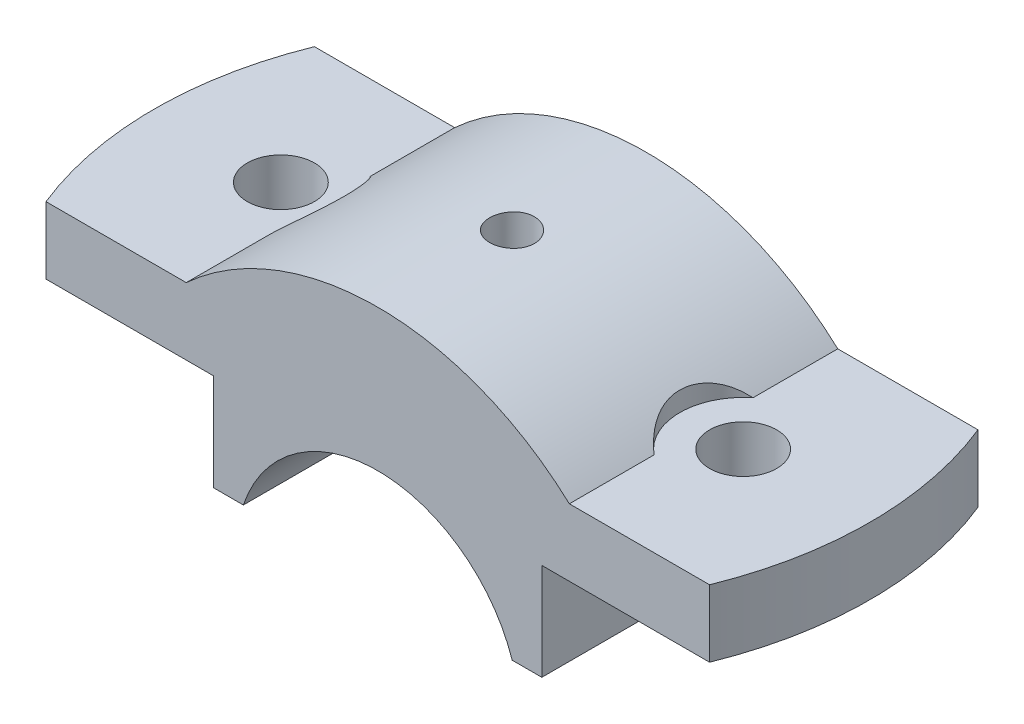
ISO-10303-21;
HEADER;
FILE_DESCRIPTION(('STEP AP214'),'2;1');
FILE_NAME('part.step','',(''),(''),'','','');
FILE_SCHEMA(('AUTOMOTIVE_DESIGN { 1 0 10303 214 1 1 1 1 }'));
ENDSEC;
DATA;
#1=APPLICATION_CONTEXT('core data for automotive mechanical design processes');
#2=APPLICATION_PROTOCOL_DEFINITION('international standard','automotive_design',2000,#1);
#3=PRODUCT_CONTEXT('',#1,'mechanical');
#4=PRODUCT('Part','Part','',(#3));
#5=PRODUCT_RELATED_PRODUCT_CATEGORY('part','',(#4));
#6=PRODUCT_DEFINITION_FORMATION('','',#4);
#7=PRODUCT_DEFINITION_CONTEXT('part definition',#1,'design');
#8=PRODUCT_DEFINITION('design','',#6,#7);
#9=PRODUCT_DEFINITION_SHAPE('','',#8);
#10=(LENGTH_UNIT() NAMED_UNIT(*) SI_UNIT(.MILLI.,.METRE.));
#11=(NAMED_UNIT(*) PLANE_ANGLE_UNIT() SI_UNIT($,.RADIAN.));
#12=(NAMED_UNIT(*) SI_UNIT($,.STERADIAN.) SOLID_ANGLE_UNIT());
#13=UNCERTAINTY_MEASURE_WITH_UNIT(LENGTH_MEASURE(1.E-05),#10,'distance_accuracy_value','');
#14=(GEOMETRIC_REPRESENTATION_CONTEXT(3) GLOBAL_UNCERTAINTY_ASSIGNED_CONTEXT((#13)) GLOBAL_UNIT_ASSIGNED_CONTEXT((#10,
#11,#12)) REPRESENTATION_CONTEXT('',''));
#15=CARTESIAN_POINT('',(0.,0.,0.));
#16=DIRECTION('',(0.,0.,1.));
#17=DIRECTION('',(1.,0.,0.));
#18=AXIS2_PLACEMENT_3D('',#15,#16,#17);
#19=CARTESIAN_POINT('',(22.,19.,18.));
#20=DIRECTION('',(0.,1.,0.));
#21=DIRECTION('',(-1.,0.,0.));
#22=AXIS2_PLACEMENT_3D('',#19,#20,#21);
#23=PLANE('',#22);
#24=CARTESIAN_POINT('',(31.,19.,0.));
#25=DIRECTION('',(0.,1.,0.));
#26=DIRECTION('',(0.,0.,1.));
#27=AXIS2_PLACEMENT_3D('',#24,#25,#26);
#28=CIRCLE('',#27,4.49999999999999);
#29=CARTESIAN_POINT('',(31.,19.,4.49999999999999));
#30=VERTEX_POINT('',#29);
#31=EDGE_CURVE('E325',#30,#30,#28,.T.);
#32=ORIENTED_EDGE('',*,*,#31,.T.);
#33=EDGE_LOOP('',(#32));
#34=FACE_BOUND('',#33,.T.);
#35=CARTESIAN_POINT('',(0.,19.,0.));
#36=DIRECTION('',(0.,1.,0.));
#37=DIRECTION('',(1.,0.,0.));
#38=AXIS2_PLACEMENT_3D('',#35,#36,#37);
#39=CIRCLE('',#38,48.);
#40=CARTESIAN_POINT('',(44.497190922574,19.,18.));
#41=VERTEX_POINT('',#40);
#42=CARTESIAN_POINT('',(44.497190922574,19.,-18.));
#43=VERTEX_POINT('',#42);
#44=EDGE_CURVE('E54',#41,#43,#39,.T.);
#45=ORIENTED_EDGE('',*,*,#44,.F.);
#46=DIRECTION('',(1.,0.,0.));
#47=VECTOR('',#46,1.);
#48=CARTESIAN_POINT('',(22.,19.,18.));
#49=LINE('',#48,#47);
#50=CARTESIAN_POINT('',(22.,19.,18.));
#51=VERTEX_POINT('',#50);
#52=EDGE_CURVE('E152',#51,#41,#49,.T.);
#53=ORIENTED_EDGE('',*,*,#52,.F.);
#54=DIRECTION('',(0.,0.,-1.));
#55=VECTOR('',#54,1.);
#56=CARTESIAN_POINT('',(22.,19.,18.));
#57=LINE('',#56,#55);
#58=CARTESIAN_POINT('',(22.,19.,-18.));
#59=VERTEX_POINT('',#58);
#60=EDGE_CURVE('E229',#51,#59,#57,.T.);
#61=ORIENTED_EDGE('',*,*,#60,.T.);
#62=DIRECTION('',(1.,0.,0.));
#63=VECTOR('',#62,1.);
#64=CARTESIAN_POINT('',(22.,19.,-18.));
#65=LINE('',#64,#63);
#66=EDGE_CURVE('E154',#59,#43,#65,.T.);
#67=ORIENTED_EDGE('',*,*,#66,.T.);
#68=EDGE_LOOP('',(#45,#53,#61,#67));
#69=FACE_BOUND('',#68,.T.);
#70=ADVANCED_FACE('F34',(#34,#69),#23,.F.);
#71=CARTESIAN_POINT('',(50.,28.,18.));
#72=DIRECTION('',(0.,-1.,0.));
#73=DIRECTION('',(1.,0.,0.));
#74=AXIS2_PLACEMENT_3D('',#71,#72,#73);
#75=PLANE('',#74);
#76=CARTESIAN_POINT('',(31.,28.,0.));
#77=DIRECTION('',(0.,1.,0.));
#78=DIRECTION('',(0.,0.,1.));
#79=AXIS2_PLACEMENT_3D('',#76,#77,#78);
#80=CIRCLE('',#79,4.49999999999999);
#81=CARTESIAN_POINT('',(31.,28.,4.49999999999999));
#82=VERTEX_POINT('',#81);
#83=EDGE_CURVE('E320',#82,#82,#80,.T.);
#84=ORIENTED_EDGE('',*,*,#83,.F.);
#85=EDGE_LOOP('',(#84));
#86=FACE_BOUND('',#85,.T.);
#87=CARTESIAN_POINT('',(0.,28.,0.));
#88=DIRECTION('',(0.,1.,0.));
#89=DIRECTION('',(1.,0.,0.));
#90=AXIS2_PLACEMENT_3D('',#87,#88,#89);
#91=CIRCLE('',#90,48.);
#92=CARTESIAN_POINT('',(44.497190922574,28.,18.));
#93=VERTEX_POINT('',#92);
#94=CARTESIAN_POINT('',(44.497190922574,28.,-18.));
#95=VERTEX_POINT('',#94);
#96=EDGE_CURVE('E141',#93,#95,#91,.T.);
#97=ORIENTED_EDGE('',*,*,#96,.T.);
#98=DIRECTION('',(-1.,0.,0.));
#99=VECTOR('',#98,1.);
#100=CARTESIAN_POINT('',(50.,28.,-18.));
#101=LINE('',#100,#99);
#102=CARTESIAN_POINT('',(25.6904651573303,28.,-18.));
#103=VERTEX_POINT('',#102);
#104=EDGE_CURVE('E188',#95,#103,#101,.T.);
#105=ORIENTED_EDGE('',*,*,#104,.T.);
#106=DIRECTION('',(0.,0.,-1.));
#107=VECTOR('',#106,1.);
#108=CARTESIAN_POINT('',(25.6904651573303,28.,18.));
#109=LINE('',#108,#107);
#110=CARTESIAN_POINT('',(25.6904651573303,28.,-6.63768331230679));
#111=VERTEX_POINT('',#110);
#112=EDGE_CURVE('E223',#111,#103,#109,.T.);
#113=ORIENTED_EDGE('',*,*,#112,.F.);
#114=CARTESIAN_POINT('',(31.,28.,0.));
#115=DIRECTION('',(0.,-1.,0.));
#116=DIRECTION('',(1.,0.,0.));
#117=AXIS2_PLACEMENT_3D('',#114,#115,#116);
#118=CIRCLE('',#117,8.5);
#119=CARTESIAN_POINT('',(25.6904651573303,28.,6.63768331230679));
#120=VERTEX_POINT('',#119);
#121=EDGE_CURVE('E61',#120,#111,#118,.T.);
#122=ORIENTED_EDGE('',*,*,#121,.F.);
#123=CARTESIAN_POINT('',(25.6904651573303,28.,18.));
#124=VERTEX_POINT('',#123);
#125=EDGE_CURVE('E230',#124,#120,#109,.T.);
#126=ORIENTED_EDGE('',*,*,#125,.F.);
#127=DIRECTION('',(-1.,0.,0.));
#128=VECTOR('',#127,1.);
#129=CARTESIAN_POINT('',(50.,28.,18.));
#130=LINE('',#129,#128);
#131=EDGE_CURVE('E160',#93,#124,#130,.T.);
#132=ORIENTED_EDGE('',*,*,#131,.F.);
#133=EDGE_LOOP('',(#97,#105,#113,#122,#126,#132));
#134=FACE_BOUND('',#133,.T.);
#135=ADVANCED_FACE('F341',(#86,#134),#75,.F.);
#136=CARTESIAN_POINT('',(0.,0.,18.));
#137=DIRECTION('',(0.,0.,1.));
#138=DIRECTION('',(1.,0.,0.));
#139=AXIS2_PLACEMENT_3D('',#136,#137,#138);
#140=PLANE('',#139);
#141=ORIENTED_EDGE('',*,*,#52,.T.);
#142=DIRECTION('',(0.,1.,0.));
#143=VECTOR('',#142,1.);
#144=CARTESIAN_POINT('',(44.497190922574,19.,18.));
#145=LINE('',#144,#143);
#146=EDGE_CURVE('E138',#41,#93,#145,.T.);
#147=ORIENTED_EDGE('',*,*,#146,.T.);
#148=ORIENTED_EDGE('',*,*,#131,.T.);
#149=CARTESIAN_POINT('',(0.,0.,18.));
#150=DIRECTION('',(0.,0.,1.));
#151=DIRECTION('',(1.,0.,0.));
#152=AXIS2_PLACEMENT_3D('',#149,#150,#151);
#153=CIRCLE('',#152,38.);
#154=CARTESIAN_POINT('',(-25.6904651573303,28.,18.));
#155=VERTEX_POINT('',#154);
#156=EDGE_CURVE('E162',#124,#155,#153,.T.);
#157=ORIENTED_EDGE('',*,*,#156,.T.);
#158=DIRECTION('',(-1.,0.,0.));
#159=VECTOR('',#158,1.);
#160=CARTESIAN_POINT('',(-50.,28.,18.));
#161=LINE('',#160,#159);
#162=CARTESIAN_POINT('',(-44.497190922574,28.,18.));
#163=VERTEX_POINT('',#162);
#164=EDGE_CURVE('E169',#155,#163,#161,.T.);
#165=ORIENTED_EDGE('',*,*,#164,.T.);
#166=DIRECTION('',(0.,1.,0.));
#167=VECTOR('',#166,1.);
#168=CARTESIAN_POINT('',(-44.497190922574,19.,18.));
#169=LINE('',#168,#167);
#170=CARTESIAN_POINT('',(-44.497190922574,19.,18.));
#171=VERTEX_POINT('',#170);
#172=EDGE_CURVE('E289',#171,#163,#169,.T.);
#173=ORIENTED_EDGE('',*,*,#172,.F.);
#174=DIRECTION('',(1.,0.,0.));
#175=VECTOR('',#174,1.);
#176=CARTESIAN_POINT('',(-22.,19.,18.));
#177=LINE('',#176,#175);
#178=CARTESIAN_POINT('',(-22.,19.,18.));
#179=VERTEX_POINT('',#178);
#180=EDGE_CURVE('E172',#171,#179,#177,.T.);
#181=ORIENTED_EDGE('',*,*,#180,.T.);
#182=DIRECTION('',(0.,-1.,0.));
#183=VECTOR('',#182,1.);
#184=CARTESIAN_POINT('',(-22.,6.,18.));
#185=LINE('',#184,#183);
#186=CARTESIAN_POINT('',(-22.,6.,18.));
#187=VERTEX_POINT('',#186);
#188=EDGE_CURVE('E174',#179,#187,#185,.T.);
#189=ORIENTED_EDGE('',*,*,#188,.T.);
#190=DIRECTION('',(1.,0.,0.));
#191=VECTOR('',#190,1.);
#192=CARTESIAN_POINT('',(-18.0277563773199,6.,18.));
#193=LINE('',#192,#191);
#194=CARTESIAN_POINT('',(-18.0277563773199,6.,18.));
#195=VERTEX_POINT('',#194);
#196=EDGE_CURVE('E176',#187,#195,#193,.T.);
#197=ORIENTED_EDGE('',*,*,#196,.T.);
#198=CARTESIAN_POINT('',(0.,0.,18.));
#199=DIRECTION('',(0.,0.,-1.));
#200=DIRECTION('',(1.,0.,0.));
#201=AXIS2_PLACEMENT_3D('',#198,#199,#200);
#202=CIRCLE('',#201,19.);
#203=CARTESIAN_POINT('',(18.0277563773199,6.00000000000001,18.));
#204=VERTEX_POINT('',#203);
#205=EDGE_CURVE('E202',#195,#204,#202,.T.);
#206=ORIENTED_EDGE('',*,*,#205,.T.);
#207=DIRECTION('',(1.,0.,0.));
#208=VECTOR('',#207,1.);
#209=CARTESIAN_POINT('',(18.0277563773199,6.00000000000001,18.));
#210=LINE('',#209,#208);
#211=CARTESIAN_POINT('',(22.,6.,18.));
#212=VERTEX_POINT('',#211);
#213=EDGE_CURVE('E164',#204,#212,#210,.T.);
#214=ORIENTED_EDGE('',*,*,#213,.T.);
#215=DIRECTION('',(0.,1.,0.));
#216=VECTOR('',#215,1.);
#217=CARTESIAN_POINT('',(22.,6.,18.));
#218=LINE('',#217,#216);
#219=EDGE_CURVE('E158',#212,#51,#218,.T.);
#220=ORIENTED_EDGE('',*,*,#219,.T.);
#221=EDGE_LOOP('',(#141,#147,#148,#157,#165,#173,#181,#189,#197,#206,#214,#220));
#222=FACE_BOUND('',#221,.T.);
#223=ADVANCED_FACE('F156',(#222),#140,.T.);
#224=CARTESIAN_POINT('',(0.,0.,-18.));
#225=DIRECTION('',(0.,0.,1.));
#226=DIRECTION('',(1.,0.,0.));
#227=AXIS2_PLACEMENT_3D('',#224,#225,#226);
#228=PLANE('',#227);
#229=DIRECTION('',(0.,1.,0.));
#230=VECTOR('',#229,1.);
#231=CARTESIAN_POINT('',(44.497190922574,19.,-18.));
#232=LINE('',#231,#230);
#233=EDGE_CURVE('E146',#43,#95,#232,.T.);
#234=ORIENTED_EDGE('',*,*,#233,.F.);
#235=ORIENTED_EDGE('',*,*,#66,.F.);
#236=DIRECTION('',(0.,1.,0.));
#237=VECTOR('',#236,1.);
#238=CARTESIAN_POINT('',(22.,6.,-18.));
#239=LINE('',#238,#237);
#240=CARTESIAN_POINT('',(22.,6.,-18.));
#241=VERTEX_POINT('',#240);
#242=EDGE_CURVE('E185',#241,#59,#239,.T.);
#243=ORIENTED_EDGE('',*,*,#242,.F.);
#244=DIRECTION('',(1.,0.,0.));
#245=VECTOR('',#244,1.);
#246=CARTESIAN_POINT('',(18.0277563773199,6.00000000000001,-18.));
#247=LINE('',#246,#245);
#248=CARTESIAN_POINT('',(18.0277563773199,6.00000000000001,-18.));
#249=VERTEX_POINT('',#248);
#250=EDGE_CURVE('E182',#249,#241,#247,.T.);
#251=ORIENTED_EDGE('',*,*,#250,.F.);
#252=CARTESIAN_POINT('',(0.,0.,-18.));
#253=DIRECTION('',(0.,0.,-1.));
#254=DIRECTION('',(1.,0.,0.));
#255=AXIS2_PLACEMENT_3D('',#252,#253,#254);
#256=CIRCLE('',#255,19.);
#257=CARTESIAN_POINT('',(-18.0277563773199,6.,-18.));
#258=VERTEX_POINT('',#257);
#259=EDGE_CURVE('E179',#258,#249,#256,.T.);
#260=ORIENTED_EDGE('',*,*,#259,.F.);
#261=DIRECTION('',(1.,0.,0.));
#262=VECTOR('',#261,1.);
#263=CARTESIAN_POINT('',(-18.0277563773199,6.,-18.));
#264=LINE('',#263,#262);
#265=CARTESIAN_POINT('',(-22.,6.,-18.));
#266=VERTEX_POINT('',#265);
#267=EDGE_CURVE('E200',#266,#258,#264,.T.);
#268=ORIENTED_EDGE('',*,*,#267,.F.);
#269=DIRECTION('',(0.,-1.,0.));
#270=VECTOR('',#269,1.);
#271=CARTESIAN_POINT('',(-22.,6.,-18.));
#272=LINE('',#271,#270);
#273=CARTESIAN_POINT('',(-22.,19.,-18.));
#274=VERTEX_POINT('',#273);
#275=EDGE_CURVE('E198',#274,#266,#272,.T.);
#276=ORIENTED_EDGE('',*,*,#275,.F.);
#277=DIRECTION('',(1.,0.,0.));
#278=VECTOR('',#277,1.);
#279=CARTESIAN_POINT('',(-22.,19.,-18.));
#280=LINE('',#279,#278);
#281=CARTESIAN_POINT('',(-44.497190922574,19.,-18.));
#282=VERTEX_POINT('',#281);
#283=EDGE_CURVE('E196',#282,#274,#280,.T.);
#284=ORIENTED_EDGE('',*,*,#283,.F.);
#285=DIRECTION('',(0.,1.,0.));
#286=VECTOR('',#285,1.);
#287=CARTESIAN_POINT('',(-44.497190922574,19.,-18.));
#288=LINE('',#287,#286);
#289=CARTESIAN_POINT('',(-44.497190922574,28.,-18.));
#290=VERTEX_POINT('',#289);
#291=EDGE_CURVE('E183',#282,#290,#288,.T.);
#292=ORIENTED_EDGE('',*,*,#291,.T.);
#293=DIRECTION('',(-1.,0.,0.));
#294=VECTOR('',#293,1.);
#295=CARTESIAN_POINT('',(-50.,28.,-18.));
#296=LINE('',#295,#294);
#297=CARTESIAN_POINT('',(-25.6904651573303,28.,-18.));
#298=VERTEX_POINT('',#297);
#299=EDGE_CURVE('E193',#298,#290,#296,.T.);
#300=ORIENTED_EDGE('',*,*,#299,.F.);
#301=CARTESIAN_POINT('',(0.,0.,-18.));
#302=DIRECTION('',(0.,0.,1.));
#303=DIRECTION('',(1.,0.,0.));
#304=AXIS2_PLACEMENT_3D('',#301,#302,#303);
#305=CIRCLE('',#304,38.);
#306=EDGE_CURVE('E190',#103,#298,#305,.T.);
#307=ORIENTED_EDGE('',*,*,#306,.F.);
#308=ORIENTED_EDGE('',*,*,#104,.F.);
#309=EDGE_LOOP('',(#234,#235,#243,#251,#260,#268,#276,#284,#292,#300,#307,#308));
#310=FACE_BOUND('',#309,.T.);
#311=ADVANCED_FACE('F304',(#310),#228,.F.);
#312=CARTESIAN_POINT('',(0.,0.,18.));
#313=DIRECTION('',(0.,0.,-1.));
#314=DIRECTION('',(-1.,0.,0.));
#315=AXIS2_PLACEMENT_3D('',#312,#313,#314);
#316=CYLINDRICAL_SURFACE('',#315,38.);
#317=CARTESIAN_POINT('',(0.,38.,3.));
#318=CARTESIAN_POINT('',(-0.168230277437706,37.9999984430739,2.99999263868346));
#319=CARTESIAN_POINT('',(-0.336575845655095,37.9988709200709,2.98580169916932));
#320=CARTESIAN_POINT('',(-0.668611397196742,37.9944814128081,2.92939894930333));
#321=CARTESIAN_POINT('',(-0.832295850092009,37.9912169949171,2.88715518982943));
#322=CARTESIAN_POINT('',(-1.15015205512757,37.9829226863334,2.77587406357067));
#323=CARTESIAN_POINT('',(-1.3043290493551,37.9778937789402,2.70685161752221));
#324=CARTESIAN_POINT('',(-1.59887136159142,37.9666348413683,2.54399853963546));
#325=CARTESIAN_POINT('',(-1.73923967362019,37.9604050724332,2.45017330191646));
#326=CARTESIAN_POINT('',(-2.00254103126273,37.9474277075509,2.24014409327318));
#327=CARTESIAN_POINT('',(-2.12543792166293,37.9406790810774,2.1238948563935));
#328=CARTESIAN_POINT('',(-2.34999780988339,37.9274332919605,1.87241281605956));
#329=CARTESIAN_POINT('',(-2.45165988585507,37.9209361402441,1.73717918887838));
#330=CARTESIAN_POINT('',(-2.63098484586302,37.9089176287414,1.45135065682847));
#331=CARTESIAN_POINT('',(-2.708616254697,37.903397552738,1.30073594623714));
#332=CARTESIAN_POINT('',(-2.83747510230931,37.8939696224707,0.988558849059875));
#333=CARTESIAN_POINT('',(-2.8887029645124,37.8900617423529,0.826996638082311));
#334=CARTESIAN_POINT('',(-2.96319644645853,37.8843090780475,0.497870679819642));
#335=CARTESIAN_POINT('',(-2.98652059882487,37.8824599758018,0.330320257357771));
#336=CARTESIAN_POINT('',(-3.00472536931325,37.8810204867557,-0.00632681714997978));
#337=CARTESIAN_POINT('',(-2.99960647157769,37.8814300615093,-0.175423442828302));
#338=CARTESIAN_POINT('',(-2.96111886260011,37.8844577346025,-0.509962310035281));
#339=CARTESIAN_POINT('',(-2.92781369865023,37.8870708648728,-0.675411913710735));
#340=CARTESIAN_POINT('',(-2.83399765916122,37.8942034046858,-0.998365215123263));
#341=CARTESIAN_POINT('',(-2.77348654183749,37.8987228311701,-1.15586884222906));
#342=CARTESIAN_POINT('',(-2.62690490032728,37.9091644380148,-1.45866214971911));
#343=CARTESIAN_POINT('',(-2.54080579129679,37.9150881856644,-1.60393793599879));
#344=CARTESIAN_POINT('',(-2.34551283184452,37.9276694800349,-1.87799978791044));
#345=CARTESIAN_POINT('',(-2.23631856235736,37.9343270400699,-2.0067855542603));
#346=CARTESIAN_POINT('',(-1.99757813910437,37.947647885739,-2.24458115896057));
#347=CARTESIAN_POINT('',(-1.86797703439473,37.9543111370687,-2.35353583758633));
#348=CARTESIAN_POINT('',(-1.59229376436976,37.9668751419437,-2.54815019879117));
#349=CARTESIAN_POINT('',(-1.44621158946689,37.9727758950454,-2.63380986781872));
#350=CARTESIAN_POINT('',(-1.14167761997914,37.983150993084,-2.77939892547026));
#351=CARTESIAN_POINT('',(-0.98322469233549,37.9876252071703,-2.83932595392175));
#352=CARTESIAN_POINT('',(-0.658463212690179,37.9946415451888,-2.93171041942903));
#353=CARTESIAN_POINT('',(-0.492154807064349,37.997183705107,-2.96416836811962));
#354=CARTESIAN_POINT('',(-0.156881478742687,38.0000448768352,-3.00062434440681));
#355=CARTESIAN_POINT('',(0.0120751089608355,38.0003698415183,-3.00469857910482));
#356=CARTESIAN_POINT('',(0.348269003373996,37.9987758913175,-2.98447098943403));
#357=CARTESIAN_POINT('',(0.515506324442481,37.9968569951891,-2.96016940224689));
#358=CARTESIAN_POINT('',(0.843297753735751,37.9909950041868,-2.88394314979588));
#359=CARTESIAN_POINT('',(1.00386010671882,37.987054491835,-2.83205372367032));
#360=CARTESIAN_POINT('',(1.31399900365978,37.9775920824189,-2.70216068710782));
#361=CARTESIAN_POINT('',(1.46357539119334,37.9720701628431,-2.62415670492505));
#362=CARTESIAN_POINT('',(1.7478437504178,37.9600494395666,-2.44405671040129));
#363=CARTESIAN_POINT('',(1.88250358772923,37.953548595394,-2.34191011569745));
#364=CARTESIAN_POINT('',(2.13279217984116,37.9403075453845,-2.1164976605111));
#365=CARTESIAN_POINT('',(2.24842063776818,37.9335673358158,-1.99323147064188));
#366=CARTESIAN_POINT('',(2.4576248497514,37.9205896766453,-1.72874864835165));
#367=CARTESIAN_POINT('',(2.55115094155127,37.9143533795852,-1.58749266904679));
#368=CARTESIAN_POINT('',(2.713155238272,37.9031055627809,-1.29123629441747));
#369=CARTESIAN_POINT('',(2.78163367119924,37.8980940318878,-1.13623602422189));
#370=CARTESIAN_POINT('',(2.89151387110068,37.8898693720601,-0.817068099787171));
#371=CARTESIAN_POINT('',(2.93294623887224,37.8866542112497,-0.652911034998949));
#372=CARTESIAN_POINT('',(2.98765790023766,37.8823793491511,-0.319943850373176));
#373=CARTESIAN_POINT('',(3.00093767292138,37.8813196111828,-0.151133809767672));
#374=CARTESIAN_POINT('',(2.99896188688675,37.8814760426207,0.18585385894292));
#375=CARTESIAN_POINT('',(2.98378436644711,37.8826859878913,0.354031953001597));
#376=CARTESIAN_POINT('',(2.92548733876923,37.887232237977,0.685442873019107));
#377=CARTESIAN_POINT('',(2.8823677867555,37.8905685461995,0.848675691052986));
#378=CARTESIAN_POINT('',(2.76943001015431,37.8989899804525,1.16556899687011));
#379=CARTESIAN_POINT('',(2.69961296444521,37.9040750292632,1.31922990697071));
#380=CARTESIAN_POINT('',(2.535271096382,37.9154210711218,1.61266178094886));
#381=CARTESIAN_POINT('',(2.44074672054795,37.9216820429175,1.75243299578316));
#382=CARTESIAN_POINT('',(2.22938062382269,37.9346948182221,2.01451680288399));
#383=CARTESIAN_POINT('',(2.11248130954252,37.941447859921,2.13678288515432));
#384=CARTESIAN_POINT('',(1.85978424897896,37.954672635902,2.36000556130416));
#385=CARTESIAN_POINT('',(1.72398192526551,37.9611443015481,2.46095697881558));
#386=CARTESIAN_POINT('',(1.43709756450133,37.9730876131211,2.63880542567551));
#387=CARTESIAN_POINT('',(1.2859897583193,37.978557527474,2.71566096437293));
#388=CARTESIAN_POINT('',(0.97307606456983,37.9878601967286,2.8428120018995));
#389=CARTESIAN_POINT('',(0.811282773093931,37.9916948408735,2.89313816633252));
#390=CARTESIAN_POINT('',(0.540438770546247,37.9963056825779,2.95292296572033));
#391=CARTESIAN_POINT('',(0.433132098217291,37.9976847801056,2.97055353917027));
#392=CARTESIAN_POINT('',(0.217232975456251,37.9995324404705,2.99409441950641));
#393=CARTESIAN_POINT('',(0.108640528034263,38.0000010054389,3.0000047538251));
#394=CARTESIAN_POINT('',(0.,38.,3.));
#395=B_SPLINE_CURVE_WITH_KNOTS('',3,(#317,#318,#319,#320,#321,#322,#323,#324,#325,#326,#327,
#328,#329,#330,#331,#332,#333,#334,#335,#336,#337,#338,#339,#340,#341,#342,#343,#344,#345,#346,
#347,#348,#349,#350,#351,#352,#353,#354,#355,#356,#357,#358,#359,#360,#361,#362,#363,#364,#365,
#366,#367,#368,#369,#370,#371,#372,#373,#374,#375,#376,#377,#378,#379,#380,#381,#382,#383,#384,
#385,#386,#387,#388,#389,#390,#391,#392,#393,#394),.UNSPECIFIED.,.T.,.F.,(4,2,2,2,2,2,2,2,2,2,2,
2,2,2,2,2,2,2,2,2,2,2,2,2,2,2,2,2,2,2,2,2,2,2,2,2,2,2,4),(0.,0.504294188546741,1.00916370078726,
1.51375230936014,2.01823126998903,2.5237394549149,3.0292695804704,3.53545907123702,
4.04164044416132,4.54675814609821,5.05186725021795,5.55584058602808,6.05981840083593,
6.56436134901272,7.06891345298728,7.57484819748388,8.08078323629979,8.58676466907349,
9.09273667730811,9.59734968185781,10.1019584685879,10.6059242398502,11.1098971854695,
11.614935538604,12.1199817691652,12.6261522324058,13.1323180879118,13.6379102536977,
14.1434938154447,14.6476929456065,15.1518928837201,15.6560705605014,16.1602391262259,
16.6657233184336,17.1713301290485,17.6778028214877,18.183688785524,18.5093549854356,
18.8350204230892),.UNSPECIFIED.);
#396=CARTESIAN_POINT('',(0.,38.,3.));
#397=VERTEX_POINT('',#396);
#398=EDGE_CURVE('E12',#397,#397,#395,.T.);
#399=ORIENTED_EDGE('',*,*,#398,.T.);
#400=EDGE_LOOP('',(#399));
#401=FACE_BOUND('',#400,.T.);
#402=CARTESIAN_POINT('',(25.6904651573303,28.,-6.63768331230679));
#403=CARTESIAN_POINT('',(25.5360851043424,28.1416681018721,-6.51420867249736));
#404=CARTESIAN_POINT('',(25.3836215551735,28.2791823336498,-6.38340380017067));
#405=CARTESIAN_POINT('',(25.0841053598261,28.5451833866574,-6.1068595072457));
#406=CARTESIAN_POINT('',(24.9370580895264,28.6736613482156,-5.96110576476092));
#407=CARTESIAN_POINT('',(24.6491941230388,28.9215085426633,-5.65349144226199));
#408=CARTESIAN_POINT('',(24.508431723833,29.0408031542341,-5.49151942353938));
#409=CARTESIAN_POINT('',(24.2363075607749,29.2682904084011,-5.15263687836668));
#410=CARTESIAN_POINT('',(24.1049430857226,29.3764862568107,-4.97573069263071));
#411=CARTESIAN_POINT('',(23.8528205053459,29.5815743674557,-4.60631493821572));
#412=CARTESIAN_POINT('',(23.7321338833277,29.6783916917415,-4.41371469093334));
#413=CARTESIAN_POINT('',(23.5043908446779,29.85908164754,-4.01479632179464));
#414=CARTESIAN_POINT('',(23.3973358972541,29.942952883943,-3.80847672492269));
#415=CARTESIAN_POINT('',(23.1992536300817,30.0966827286364,-3.38422419101504));
#416=CARTESIAN_POINT('',(23.1081729651954,30.1665880882949,-3.1663331999127));
#417=CARTESIAN_POINT('',(22.9434688496595,30.2920447623401,-2.72008092153074));
#418=CARTESIAN_POINT('',(22.869842066784,30.347598816803,-2.49172164276593));
#419=CARTESIAN_POINT('',(22.7499342032063,30.4375648556656,-2.05682098381955));
#420=CARTESIAN_POINT('',(22.7013462567531,30.4737833576563,-1.85128534823191));
#421=CARTESIAN_POINT('',(22.6194172898017,30.534645499234,-1.43551725204115));
#422=CARTESIAN_POINT('',(22.5860747992536,30.5592902548309,-1.2252852463389));
#423=CARTESIAN_POINT('',(22.5352129551669,30.5968164834569,-0.801799591498526));
#424=CARTESIAN_POINT('',(22.5176992505084,30.6096937569973,-0.588544891193921));
#425=CARTESIAN_POINT('',(22.4988301660851,30.6235658271181,-0.160939560666234));
#426=CARTESIAN_POINT('',(22.4974739036633,30.624561272785,0.053411009051133));
#427=CARTESIAN_POINT('',(22.5103301119086,30.6151119876343,0.461997479818149));
#428=CARTESIAN_POINT('',(22.5231488228924,30.6056914251709,0.656303160135774));
#429=CARTESIAN_POINT('',(22.5619809221014,30.5770763766543,1.04286259298841));
#430=CARTESIAN_POINT('',(22.5879939672906,30.5578821447042,1.23511639873688));
#431=CARTESIAN_POINT('',(22.6528192304938,30.5098574663833,1.61613906729809));
#432=CARTESIAN_POINT('',(22.6916259266854,30.4810311771979,1.80490939654949));
#433=CARTESIAN_POINT('',(22.7814851533843,30.4139289484325,2.17779604427594));
#434=CARTESIAN_POINT('',(22.8325379785097,30.3756527815061,2.36191225066403));
#435=CARTESIAN_POINT('',(22.9463727274414,30.2897519777021,2.72495933677603));
#436=CARTESIAN_POINT('',(23.0091940590921,30.2420959034169,2.90387039063447));
#437=CARTESIAN_POINT('',(23.1456283742011,30.1378044455698,3.2548914886335));
#438=CARTESIAN_POINT('',(23.2192449894415,30.0811660396201,3.4269992191435));
#439=CARTESIAN_POINT('',(23.3763137314078,29.9592695660632,3.76349373210636));
#440=CARTESIAN_POINT('',(23.4597660818508,29.8940113023904,3.92788033882066));
#441=CARTESIAN_POINT('',(23.635527045378,29.7552415450916,4.24828704232643));
#442=CARTESIAN_POINT('',(23.7278387953854,29.6817271265587,4.40430414494655));
#443=CARTESIAN_POINT('',(23.9282386479047,29.5204551498758,4.71995510834892));
#444=CARTESIAN_POINT('',(24.0370002176616,29.432022004933,4.87881602386906));
#445=CARTESIAN_POINT('',(24.2623844714665,29.2465042091278,5.1856332961988));
#446=CARTESIAN_POINT('',(24.379010630913,29.1494157272481,5.33358477081362));
#447=CARTESIAN_POINT('',(24.6187042069683,28.9472618083659,5.61815393006346));
#448=CARTESIAN_POINT('',(24.7417672458198,28.8422017715012,5.75477915839727));
#449=CARTESIAN_POINT('',(24.9931857635632,28.6246099475779,6.016738259449));
#450=CARTESIAN_POINT('',(25.121541230047,28.5120781780363,6.14207215863704));
#451=CARTESIAN_POINT('',(25.3239635142993,28.3320696328102,6.32788833390874));
#452=CARTESIAN_POINT('',(25.3966039536003,28.2669811541268,6.39227987552885));
#453=CARTESIAN_POINT('',(25.5428336292653,28.1349133065772,6.51755974656749));
#454=CARTESIAN_POINT('',(25.6164208573993,28.0679376662269,6.57845434819235));
#455=CARTESIAN_POINT('',(25.6904651573302,28.0000000000002,6.63768331230705));
#456=B_SPLINE_CURVE_WITH_KNOTS('',3,(#402,#403,#404,#405,#406,#407,#408,#409,#410,#411,#412,
#413,#414,#415,#416,#417,#418,#419,#420,#421,#422,#423,#424,#425,#426,#427,#428,#429,#430,#431,
#432,#433,#434,#435,#436,#437,#438,#439,#440,#441,#442,#443,#444,#445,#446,#447,#448,#449,#450,
#451,#452,#453,#454,#455),.UNSPECIFIED.,.F.,.F.,(4,2,2,2,2,2,2,2,2,2,2,2,2,2,2,2,2,2,2,2,2,2,2,
2,2,2,4),(0.,0.729592400834072,1.45989044138351,2.19560470883998,2.93110586753775,
3.67120763552797,4.41138910352642,5.14904966030396,5.88656927223679,6.52855006409984,
7.17046893961488,7.81261680885219,8.45472959834444,9.03890309081731,9.62306139629813,
10.2069679046447,10.7908884620571,11.3768004587137,11.9629100238154,12.549032922753,
13.1353641263273,13.7703169673958,14.4055522594533,15.040361004022,15.6751682603777,
16.0257258218313,16.3756336015193),.UNSPECIFIED.);
#457=EDGE_CURVE('E47',#111,#120,#456,.T.);
#458=ORIENTED_EDGE('',*,*,#457,.F.);
#459=ORIENTED_EDGE('',*,*,#112,.T.);
#460=ORIENTED_EDGE('',*,*,#306,.T.);
#461=DIRECTION('',(0.,0.,-1.));
#462=VECTOR('',#461,1.);
#463=CARTESIAN_POINT('',(-25.6904651573303,28.,18.));
#464=LINE('',#463,#462);
#465=CARTESIAN_POINT('',(-25.6904651573303,28.,-6.63768331230679));
#466=VERTEX_POINT('',#465);
#467=EDGE_CURVE('E211',#466,#298,#464,.T.);
#468=ORIENTED_EDGE('',*,*,#467,.F.);
#469=CARTESIAN_POINT('',(-25.6904651573303,28.,-6.63768331230679));
#470=CARTESIAN_POINT('',(-25.5360851043424,28.1416681018721,-6.51420867249736));
#471=CARTESIAN_POINT('',(-25.3836215551735,28.2791823336498,-6.38340380017067));
#472=CARTESIAN_POINT('',(-25.0841053598261,28.5451833866574,-6.1068595072457));
#473=CARTESIAN_POINT('',(-24.9370580895264,28.6736613482156,-5.96110576476092));
#474=CARTESIAN_POINT('',(-24.6491941230388,28.9215085426633,-5.65349144226199));
#475=CARTESIAN_POINT('',(-24.508431723833,29.0408031542341,-5.49151942353938));
#476=CARTESIAN_POINT('',(-24.2363075607749,29.2682904084011,-5.15263687836668));
#477=CARTESIAN_POINT('',(-24.1049430857226,29.3764862568107,-4.97573069263071));
#478=CARTESIAN_POINT('',(-23.8528205053459,29.5815743674557,-4.60631493821572));
#479=CARTESIAN_POINT('',(-23.7321338833277,29.6783916917415,-4.41371469093334));
#480=CARTESIAN_POINT('',(-23.5043908446779,29.85908164754,-4.01479632179464));
#481=CARTESIAN_POINT('',(-23.3973358972541,29.942952883943,-3.80847672492269));
#482=CARTESIAN_POINT('',(-23.1992536300817,30.0966827286364,-3.38422419101504));
#483=CARTESIAN_POINT('',(-23.1081729651954,30.1665880882949,-3.1663331999127));
#484=CARTESIAN_POINT('',(-22.9434688496595,30.2920447623401,-2.72008092153074));
#485=CARTESIAN_POINT('',(-22.869842066784,30.347598816803,-2.49172164276593));
#486=CARTESIAN_POINT('',(-22.7499342032063,30.4375648556656,-2.05682098381955));
#487=CARTESIAN_POINT('',(-22.7013462567531,30.4737833576563,-1.85128534823191));
#488=CARTESIAN_POINT('',(-22.6194172898017,30.534645499234,-1.43551725204115));
#489=CARTESIAN_POINT('',(-22.5860747992536,30.5592902548309,-1.2252852463389));
#490=CARTESIAN_POINT('',(-22.5352129551669,30.5968164834569,-0.801799591498526));
#491=CARTESIAN_POINT('',(-22.5176992505084,30.6096937569973,-0.588544891193921));
#492=CARTESIAN_POINT('',(-22.4988301660851,30.6235658271181,-0.160939560666234));
#493=CARTESIAN_POINT('',(-22.4974739036633,30.624561272785,0.053411009051133));
#494=CARTESIAN_POINT('',(-22.5103301119086,30.6151119876343,0.461997479818149));
#495=CARTESIAN_POINT('',(-22.5231488228924,30.6056914251709,0.656303160135774));
#496=CARTESIAN_POINT('',(-22.5619809221014,30.5770763766543,1.04286259298841));
#497=CARTESIAN_POINT('',(-22.5879939672906,30.5578821447042,1.23511639873688));
#498=CARTESIAN_POINT('',(-22.6528192304938,30.5098574663833,1.61613906729809));
#499=CARTESIAN_POINT('',(-22.6916259266854,30.4810311771979,1.80490939654949));
#500=CARTESIAN_POINT('',(-22.7814851533843,30.4139289484325,2.17779604427594));
#501=CARTESIAN_POINT('',(-22.8325379785097,30.3756527815061,2.36191225066403));
#502=CARTESIAN_POINT('',(-22.9463727274414,30.2897519777021,2.72495933677603));
#503=CARTESIAN_POINT('',(-23.0091940590921,30.2420959034169,2.90387039063447));
#504=CARTESIAN_POINT('',(-23.1456283742011,30.1378044455698,3.2548914886335));
#505=CARTESIAN_POINT('',(-23.2192449894415,30.0811660396201,3.4269992191435));
#506=CARTESIAN_POINT('',(-23.3763137314078,29.9592695660632,3.76349373210636));
#507=CARTESIAN_POINT('',(-23.4597660818508,29.8940113023904,3.92788033882066));
#508=CARTESIAN_POINT('',(-23.635527045378,29.7552415450916,4.24828704232643));
#509=CARTESIAN_POINT('',(-23.7278387953854,29.6817271265587,4.40430414494655));
#510=CARTESIAN_POINT('',(-23.9282386479047,29.5204551498758,4.71995510834892));
#511=CARTESIAN_POINT('',(-24.0370002176616,29.432022004933,4.87881602386906));
#512=CARTESIAN_POINT('',(-24.2623844714665,29.2465042091278,5.1856332961988));
#513=CARTESIAN_POINT('',(-24.379010630913,29.1494157272481,5.33358477081362));
#514=CARTESIAN_POINT('',(-24.6187042069683,28.9472618083659,5.61815393006346));
#515=CARTESIAN_POINT('',(-24.7417672458198,28.8422017715012,5.75477915839727));
#516=CARTESIAN_POINT('',(-24.9931857635632,28.6246099475779,6.016738259449));
#517=CARTESIAN_POINT('',(-25.121541230047,28.5120781780363,6.14207215863704));
#518=CARTESIAN_POINT('',(-25.3239635142993,28.3320696328102,6.32788833390874));
#519=CARTESIAN_POINT('',(-25.3966039536003,28.2669811541268,6.39227987552885));
#520=CARTESIAN_POINT('',(-25.5428336292653,28.1349133065772,6.51755974656749));
#521=CARTESIAN_POINT('',(-25.6164208573994,28.0679376662269,6.57845434819235));
#522=CARTESIAN_POINT('',(-25.6904651573302,28.0000000000002,6.63768331230705));
#523=B_SPLINE_CURVE_WITH_KNOTS('',3,(#469,#470,#471,#472,#473,#474,#475,#476,#477,#478,#479,
#480,#481,#482,#483,#484,#485,#486,#487,#488,#489,#490,#491,#492,#493,#494,#495,#496,#497,#498,
#499,#500,#501,#502,#503,#504,#505,#506,#507,#508,#509,#510,#511,#512,#513,#514,#515,#516,#517,
#518,#519,#520,#521,#522),.UNSPECIFIED.,.F.,.F.,(4,2,2,2,2,2,2,2,2,2,2,2,2,2,2,2,2,2,2,2,2,2,2,
2,2,2,4),(0.,0.729592400834072,1.45989044138351,2.19560470883998,2.93110586753775,
3.67120763552797,4.41138910352642,5.14904966030396,5.88656927223679,6.52855006409984,
7.17046893961488,7.81261680885219,8.45472959834444,9.03890309081731,9.62306139629813,
10.2069679046447,10.7908884620571,11.3768004587137,11.9629100238154,12.549032922753,
13.1353641263273,13.7703169673958,14.4055522594533,15.040361004022,15.6751682603777,
16.0257258218313,16.3756336015193),.UNSPECIFIED.);
#524=CARTESIAN_POINT('',(-25.6904651573303,28.,6.63768331230679));
#525=VERTEX_POINT('',#524);
#526=EDGE_CURVE('E277',#466,#525,#523,.T.);
#527=ORIENTED_EDGE('',*,*,#526,.T.);
#528=EDGE_CURVE('E220',#155,#525,#464,.T.);
#529=ORIENTED_EDGE('',*,*,#528,.F.);
#530=ORIENTED_EDGE('',*,*,#156,.F.);
#531=ORIENTED_EDGE('',*,*,#125,.T.);
#532=EDGE_LOOP('',(#458,#459,#460,#468,#527,#529,#530,#531));
#533=FACE_BOUND('',#532,.T.);
#534=ADVANCED_FACE('F248',(#401,#533),#316,.T.);
#535=CARTESIAN_POINT('',(0.,0.,18.));
#536=DIRECTION('',(0.,0.,-1.));
#537=DIRECTION('',(-1.,0.,0.));
#538=AXIS2_PLACEMENT_3D('',#535,#536,#537);
#539=CYLINDRICAL_SURFACE('',#538,19.);
#540=CARTESIAN_POINT('',(0.,19.,2.49999999999999));
#541=CARTESIAN_POINT('',(0.139778315489381,18.999997967774,2.49999410094607));
#542=CARTESIAN_POINT('',(0.279642447495432,18.9984412683557,2.48823767475851));
#543=CARTESIAN_POINT('',(0.555474474016764,18.9923810422329,2.44152700403634));
#544=CARTESIAN_POINT('',(0.691438217949602,18.9878744896332,2.40654893872552));
#545=CARTESIAN_POINT('',(0.955436642925263,18.9764219373405,2.31444705906101));
#546=CARTESIAN_POINT('',(1.08347675216936,18.9694776299244,2.25733860465933));
#547=CARTESIAN_POINT('',(1.32813277832855,18.9539206812215,2.12263165454414));
#548=CARTESIAN_POINT('',(1.44475055826477,18.9453083126858,2.04503650793576));
#549=CARTESIAN_POINT('',(1.66398308687909,18.9273173646443,1.87105538112386));
#550=CARTESIAN_POINT('',(1.76651843289981,18.9179348817316,1.77456973952705));
#551=CARTESIAN_POINT('',(1.95399133146887,18.8994924119599,1.56576064733009));
#552=CARTESIAN_POINT('',(2.0389279601093,18.890432442053,1.4534363657436));
#553=CARTESIAN_POINT('',(2.18909162338547,18.8736225658863,1.21561789849417));
#554=CARTESIAN_POINT('',(2.254243636291,18.8658776941045,1.09007595594652));
#555=CARTESIAN_POINT('',(2.36250946256607,18.8526269269547,0.82971330966885));
#556=CARTESIAN_POINT('',(2.40562420041089,18.8471209376663,0.694892995440666));
#557=CARTESIAN_POINT('',(2.46834893112872,18.8390089488849,0.420627771177585));
#558=CARTESIAN_POINT('',(2.48809350572304,18.8363863510935,0.281214139706503));
#559=CARTESIAN_POINT('',(2.50393399543624,18.8342874081065,0.00102942145374126));
#560=CARTESIAN_POINT('',(2.50003096100306,18.8348109231579,-0.139741604753912));
#561=CARTESIAN_POINT('',(2.46879737750757,18.8389298660036,-0.417704097944482));
#562=CARTESIAN_POINT('',(2.44161547626707,18.8425058020086,-0.554912597936803));
#563=CARTESIAN_POINT('',(2.36482786882149,18.852296258763,-0.822803762753464));
#564=CARTESIAN_POINT('',(2.31522166359116,18.8585108382319,-0.95348628227828));
#565=CARTESIAN_POINT('',(2.19483509097755,18.8729003199956,-1.20507533515602));
#566=CARTESIAN_POINT('',(2.12399053069557,18.8810811502029,-1.3259507990106));
#567=CARTESIAN_POINT('',(1.96318413435717,18.8984768576706,-1.55415393130079));
#568=CARTESIAN_POINT('',(1.87322133002782,18.9076917872934,-1.66148091311362));
#569=CARTESIAN_POINT('',(1.67591027855668,18.9262039286229,-1.8604029509214));
#570=CARTESIAN_POINT('',(1.5684339827901,18.9355012293485,-1.95187103488117));
#571=CARTESIAN_POINT('',(1.33958658891131,18.9530645440151,-2.11548884034055));
#572=CARTESIAN_POINT('',(1.21821545257772,18.9613305551191,-2.18763850869799));
#573=CARTESIAN_POINT('',(0.964922757293814,18.9759058695861,-2.31057308687671));
#574=CARTESIAN_POINT('',(0.832997072631037,18.9822144030351,-2.36134959301125));
#575=CARTESIAN_POINT('',(0.562390331231886,18.9921571388021,-2.43999334343768));
#576=CARTESIAN_POINT('',(0.423709625549348,18.9957914799383,-2.4678617769038));
#577=CARTESIAN_POINT('',(0.144626841595052,18.9999582136113,-2.49973268466772));
#578=CARTESIAN_POINT('',(0.0042450539790031,19.0005133278906,-2.50390998199236));
#579=CARTESIAN_POINT('',(-0.275216665266614,18.9985205333266,-2.48874205734629));
#580=CARTESIAN_POINT('',(-0.414296627611642,18.9959726978817,-2.46939739177319));
#581=CARTESIAN_POINT('',(-0.686687509149987,18.9880744020358,-2.40787994096775));
#582=CARTESIAN_POINT('',(-0.820017679004481,18.9827342327916,-2.36579096106223));
#583=CARTESIAN_POINT('',(-1.07772769061604,18.9698488481686,-2.26006706877667));
#584=CARTESIAN_POINT('',(-1.20210719868892,18.9623035506347,-2.19643135362992));
#585=CARTESIAN_POINT('',(-1.43916303555311,18.9457917882835,-2.04900056518348));
#586=CARTESIAN_POINT('',(-1.55176881159962,18.9368174879556,-1.96509294211364));
#587=CARTESIAN_POINT('',(-1.76136182953435,18.9184749473973,-1.77965876593364));
#588=CARTESIAN_POINT('',(-1.85834838132062,18.9091066897838,-1.67813143474596));
#589=CARTESIAN_POINT('',(-2.03457405133124,18.8909615049602,-1.45956767417581));
#590=CARTESIAN_POINT('',(-2.11369695379328,18.882188695812,-1.34243714901302));
#591=CARTESIAN_POINT('',(-2.25114524350548,18.8662967388838,-1.0964463235499));
#592=CARTESIAN_POINT('',(-2.30947108507654,18.8591775549807,-0.967586279563251));
#593=CARTESIAN_POINT('',(-2.40348340588749,18.8474274353122,-0.702162244798241));
#594=CARTESIAN_POINT('',(-2.43923433050313,18.8427894223098,-0.565621407141435));
#595=CARTESIAN_POINT('',(-2.48728896692711,18.8365068588229,-0.288409154438022));
#596=CARTESIAN_POINT('',(-2.49959389747028,18.834862152745,-0.14773795447576));
#597=CARTESIAN_POINT('',(-2.50038325713136,18.8347572836292,0.132585217903332));
#598=CARTESIAN_POINT('',(-2.48905029281034,18.8362727080523,0.272236701943021));
#599=CARTESIAN_POINT('',(-2.44327339157393,18.8422647251657,0.547631014500266));
#600=CARTESIAN_POINT('',(-2.40882946081797,18.8467413170668,0.683373844059529));
#601=CARTESIAN_POINT('',(-2.31786734754336,18.8581434764999,0.947066981095644));
#602=CARTESIAN_POINT('',(-2.26135895042261,18.8650679582854,1.0750207139318));
#603=CARTESIAN_POINT('',(-2.12788991460023,18.8805873470396,1.3196597242388));
#604=CARTESIAN_POINT('',(-2.05092891076783,18.8891822838294,1.4363448004849));
#605=CARTESIAN_POINT('',(-1.87806508524071,18.9071536004537,1.65606643442981));
#606=CARTESIAN_POINT('',(-1.78202633147283,18.916535291463,1.75899562327552));
#607=CARTESIAN_POINT('',(-1.57401834863999,18.9349767535594,1.94734544374448));
#608=CARTESIAN_POINT('',(-1.46204538383397,18.9440364485309,2.03276195806478));
#609=CARTESIAN_POINT('',(-1.22480279057949,18.9608556769231,2.1839722390681));
#610=CARTESIAN_POINT('',(-1.09947920166897,18.9686095798624,2.24968193582438));
#611=CARTESIAN_POINT('',(-0.839540973043681,18.9818871351467,2.35902730105119));
#612=CARTESIAN_POINT('',(-0.704936491101719,18.9874131818538,2.40268668066817));
#613=CARTESIAN_POINT('',(-0.474714442967835,18.9942975150946,2.45637452622467));
#614=CARTESIAN_POINT('',(-0.380541684686489,18.9964253917168,2.47271020697246));
#615=CARTESIAN_POINT('',(-0.190925958585041,18.9992773223142,2.49452491255805));
#616=CARTESIAN_POINT('',(-0.0954830015668619,19.0000013882199,2.50000402966206));
#617=CARTESIAN_POINT('',(0.,19.,2.49999999999999));
#618=B_SPLINE_CURVE_WITH_KNOTS('',3,(#540,#541,#542,#543,#544,#545,#546,#547,#548,#549,#550,
#551,#552,#553,#554,#555,#556,#557,#558,#559,#560,#561,#562,#563,#564,#565,#566,#567,#568,#569,
#570,#571,#572,#573,#574,#575,#576,#577,#578,#579,#580,#581,#582,#583,#584,#585,#586,#587,#588,
#589,#590,#591,#592,#593,#594,#595,#596,#597,#598,#599,#600,#601,#602,#603,#604,#605,#606,#607,
#608,#609,#610,#611,#612,#613,#614,#615,#616,#617),.UNSPECIFIED.,.T.,.F.,(4,2,2,2,2,2,2,2,2,2,2,
2,2,2,2,2,2,2,2,2,2,2,2,2,2,2,2,2,2,2,2,2,2,2,2,2,2,2,4),(0.,0.418986144750715,
0.838402751295032,1.25752877489171,1.67658632335898,2.09791737096997,2.5192705322666,
2.94220203521432,3.36511579450622,3.78558208482052,4.20602969778295,4.62381238038423,
5.04160436068184,5.46067207111285,5.87976101093415,6.30206422391833,6.72436859858556,
7.14683886382432,7.56928719694783,7.98861407741508,8.40793103915518,8.82571338706287,
9.24351130200043,9.66368440831748,10.0838760739927,10.5067272952287,10.9295692785285,
11.3511986374782,11.7728060793191,12.1911686022117,12.6095310136043,13.027708095279,
13.4458926429742,13.8671712161902,14.2885487204711,14.7116990687392,15.1343934209874,
15.4206065905888,15.7068173277526),.UNSPECIFIED.);
#619=CARTESIAN_POINT('',(0.,19.,2.49999999999999));
#620=VERTEX_POINT('',#619);
#621=EDGE_CURVE('E39',#620,#620,#618,.T.);
#622=ORIENTED_EDGE('',*,*,#621,.T.);
#623=EDGE_LOOP('',(#622));
#624=FACE_BOUND('',#623,.T.);
#625=ORIENTED_EDGE('',*,*,#259,.T.);
#626=DIRECTION('',(0.,0.,-1.));
#627=VECTOR('',#626,1.);
#628=CARTESIAN_POINT('',(18.0277563773199,6.00000000000001,18.));
#629=LINE('',#628,#627);
#630=EDGE_CURVE('E224',#204,#249,#629,.T.);
#631=ORIENTED_EDGE('',*,*,#630,.F.);
#632=ORIENTED_EDGE('',*,*,#205,.F.);
#633=DIRECTION('',(0.,0.,-1.));
#634=VECTOR('',#633,1.);
#635=CARTESIAN_POINT('',(-18.0277563773199,6.,18.));
#636=LINE('',#635,#634);
#637=EDGE_CURVE('E178',#195,#258,#636,.T.);
#638=ORIENTED_EDGE('',*,*,#637,.T.);
#639=EDGE_LOOP('',(#625,#631,#632,#638));
#640=FACE_BOUND('',#639,.T.);
#641=ADVANCED_FACE('F36',(#624,#640),#539,.F.);
#642=CARTESIAN_POINT('',(18.0277563773199,6.00000000000001,18.));
#643=DIRECTION('',(0.,1.,0.));
#644=DIRECTION('',(-1.,0.,0.));
#645=AXIS2_PLACEMENT_3D('',#642,#643,#644);
#646=PLANE('',#645);
#647=ORIENTED_EDGE('',*,*,#250,.T.);
#648=DIRECTION('',(0.,0.,-1.));
#649=VECTOR('',#648,1.);
#650=CARTESIAN_POINT('',(22.,6.,18.));
#651=LINE('',#650,#649);
#652=EDGE_CURVE('E227',#212,#241,#651,.T.);
#653=ORIENTED_EDGE('',*,*,#652,.F.);
#654=ORIENTED_EDGE('',*,*,#213,.F.);
#655=ORIENTED_EDGE('',*,*,#630,.T.);
#656=EDGE_LOOP('',(#647,#653,#654,#655));
#657=FACE_BOUND('',#656,.T.);
#658=ADVANCED_FACE('F299',(#657),#646,.F.);
#659=CARTESIAN_POINT('',(22.,6.,18.));
#660=DIRECTION('',(-1.,0.,0.));
#661=DIRECTION('',(0.,0.,1.));
#662=AXIS2_PLACEMENT_3D('',#659,#660,#661);
#663=PLANE('',#662);
#664=ORIENTED_EDGE('',*,*,#242,.T.);
#665=ORIENTED_EDGE('',*,*,#60,.F.);
#666=ORIENTED_EDGE('',*,*,#219,.F.);
#667=ORIENTED_EDGE('',*,*,#652,.T.);
#668=EDGE_LOOP('',(#664,#665,#666,#667));
#669=FACE_BOUND('',#668,.T.);
#670=ADVANCED_FACE('F302',(#669),#663,.F.);
#671=CARTESIAN_POINT('',(-50.,28.,18.));
#672=DIRECTION('',(0.,-1.,0.));
#673=DIRECTION('',(1.,0.,0.));
#674=AXIS2_PLACEMENT_3D('',#671,#672,#673);
#675=PLANE('',#674);
#676=CARTESIAN_POINT('',(-31.,28.,0.));
#677=DIRECTION('',(0.,1.,0.));
#678=DIRECTION('',(0.,0.,1.));
#679=AXIS2_PLACEMENT_3D('',#676,#677,#678);
#680=CIRCLE('',#679,4.49999999999999);
#681=CARTESIAN_POINT('',(-31.,28.,4.49999999999999));
#682=VERTEX_POINT('',#681);
#683=EDGE_CURVE('E279',#682,#682,#680,.T.);
#684=ORIENTED_EDGE('',*,*,#683,.F.);
#685=EDGE_LOOP('',(#684));
#686=FACE_BOUND('',#685,.T.);
#687=ORIENTED_EDGE('',*,*,#299,.T.);
#688=CARTESIAN_POINT('',(0.,28.,0.));
#689=DIRECTION('',(0.,-1.,0.));
#690=DIRECTION('',(-1.,0.,0.));
#691=AXIS2_PLACEMENT_3D('',#688,#689,#690);
#692=CIRCLE('',#691,48.);
#693=EDGE_CURVE('E285',#163,#290,#692,.T.);
#694=ORIENTED_EDGE('',*,*,#693,.F.);
#695=ORIENTED_EDGE('',*,*,#164,.F.);
#696=ORIENTED_EDGE('',*,*,#528,.T.);
#697=CARTESIAN_POINT('',(-31.,28.,0.));
#698=DIRECTION('',(0.,1.,0.));
#699=DIRECTION('',(-1.,0.,0.));
#700=AXIS2_PLACEMENT_3D('',#697,#698,#699);
#701=CIRCLE('',#700,8.5);
#702=EDGE_CURVE('E328',#525,#466,#701,.T.);
#703=ORIENTED_EDGE('',*,*,#702,.T.);
#704=ORIENTED_EDGE('',*,*,#467,.T.);
#705=EDGE_LOOP('',(#687,#694,#695,#696,#703,#704));
#706=FACE_BOUND('',#705,.T.);
#707=ADVANCED_FACE('F336',(#686,#706),#675,.F.);
#708=CARTESIAN_POINT('',(-22.,19.,18.));
#709=DIRECTION('',(0.,1.,0.));
#710=DIRECTION('',(-1.,0.,0.));
#711=AXIS2_PLACEMENT_3D('',#708,#709,#710);
#712=PLANE('',#711);
#713=CARTESIAN_POINT('',(-31.,19.,0.));
#714=DIRECTION('',(0.,1.,0.));
#715=DIRECTION('',(0.,0.,1.));
#716=AXIS2_PLACEMENT_3D('',#713,#714,#715);
#717=CIRCLE('',#716,4.49999999999999);
#718=CARTESIAN_POINT('',(-31.,19.,4.49999999999999));
#719=VERTEX_POINT('',#718);
#720=EDGE_CURVE('E282',#719,#719,#717,.T.);
#721=ORIENTED_EDGE('',*,*,#720,.T.);
#722=EDGE_LOOP('',(#721));
#723=FACE_BOUND('',#722,.T.);
#724=ORIENTED_EDGE('',*,*,#180,.F.);
#725=CARTESIAN_POINT('',(0.,19.,0.));
#726=DIRECTION('',(0.,-1.,0.));
#727=DIRECTION('',(-1.,0.,0.));
#728=AXIS2_PLACEMENT_3D('',#725,#726,#727);
#729=CIRCLE('',#728,48.);
#730=EDGE_CURVE('E286',#171,#282,#729,.T.);
#731=ORIENTED_EDGE('',*,*,#730,.T.);
#732=ORIENTED_EDGE('',*,*,#283,.T.);
#733=DIRECTION('',(0.,0.,-1.));
#734=VECTOR('',#733,1.);
#735=CARTESIAN_POINT('',(-22.,19.,18.));
#736=LINE('',#735,#734);
#737=EDGE_CURVE('E208',#179,#274,#736,.T.);
#738=ORIENTED_EDGE('',*,*,#737,.F.);
#739=EDGE_LOOP('',(#724,#731,#732,#738));
#740=FACE_BOUND('',#739,.T.);
#741=ADVANCED_FACE('F349',(#723,#740),#712,.F.);
#742=CARTESIAN_POINT('',(-22.,6.,18.));
#743=DIRECTION('',(1.,0.,0.));
#744=DIRECTION('',(0.,0.,-1.));
#745=AXIS2_PLACEMENT_3D('',#742,#743,#744);
#746=PLANE('',#745);
#747=ORIENTED_EDGE('',*,*,#275,.T.);
#748=DIRECTION('',(0.,0.,-1.));
#749=VECTOR('',#748,1.);
#750=CARTESIAN_POINT('',(-22.,6.,18.));
#751=LINE('',#750,#749);
#752=EDGE_CURVE('E205',#187,#266,#751,.T.);
#753=ORIENTED_EDGE('',*,*,#752,.F.);
#754=ORIENTED_EDGE('',*,*,#188,.F.);
#755=ORIENTED_EDGE('',*,*,#737,.T.);
#756=EDGE_LOOP('',(#747,#753,#754,#755));
#757=FACE_BOUND('',#756,.T.);
#758=ADVANCED_FACE('F356',(#757),#746,.F.);
#759=CARTESIAN_POINT('',(-18.0277563773199,6.,18.));
#760=DIRECTION('',(0.,1.,0.));
#761=DIRECTION('',(-1.,0.,0.));
#762=AXIS2_PLACEMENT_3D('',#759,#760,#761);
#763=PLANE('',#762);
#764=ORIENTED_EDGE('',*,*,#267,.T.);
#765=ORIENTED_EDGE('',*,*,#637,.F.);
#766=ORIENTED_EDGE('',*,*,#196,.F.);
#767=ORIENTED_EDGE('',*,*,#752,.T.);
#768=EDGE_LOOP('',(#764,#765,#766,#767));
#769=FACE_BOUND('',#768,.T.);
#770=ADVANCED_FACE('F359',(#769),#763,.F.);
#771=CARTESIAN_POINT('',(0.,19.,0.));
#772=DIRECTION('',(0.,1.,0.));
#773=DIRECTION('',(-1.,0.,0.));
#774=AXIS2_PLACEMENT_3D('',#771,#772,#773);
#775=CYLINDRICAL_SURFACE('',#774,48.);
#776=ORIENTED_EDGE('',*,*,#693,.T.);
#777=ORIENTED_EDGE('',*,*,#291,.F.);
#778=ORIENTED_EDGE('',*,*,#730,.F.);
#779=ORIENTED_EDGE('',*,*,#172,.T.);
#780=EDGE_LOOP('',(#776,#777,#778,#779));
#781=FACE_BOUND('',#780,.T.);
#782=ADVANCED_FACE('F347',(#781),#775,.T.);
#783=CARTESIAN_POINT('',(-31.,28.,0.));
#784=DIRECTION('',(0.,1.,0.));
#785=DIRECTION('',(0.,0.,1.));
#786=AXIS2_PLACEMENT_3D('',#783,#784,#785);
#787=CYLINDRICAL_SURFACE('',#786,4.49999999999999);
#788=ORIENTED_EDGE('',*,*,#720,.F.);
#789=EDGE_LOOP('',(#788));
#790=FACE_BOUND('',#789,.T.);
#791=ORIENTED_EDGE('',*,*,#683,.T.);
#792=EDGE_LOOP('',(#791));
#793=FACE_BOUND('',#792,.T.);
#794=ADVANCED_FACE('F267',(#790,#793),#787,.F.);
#795=CARTESIAN_POINT('',(-31.,28.,0.));
#796=DIRECTION('',(0.,1.,0.));
#797=DIRECTION('',(0.,0.,1.));
#798=AXIS2_PLACEMENT_3D('',#795,#796,#797);
#799=CYLINDRICAL_SURFACE('',#798,8.5);
#800=ORIENTED_EDGE('',*,*,#702,.F.);
#801=ORIENTED_EDGE('',*,*,#526,.F.);
#802=EDGE_LOOP('',(#800,#801));
#803=FACE_BOUND('',#802,.T.);
#804=ADVANCED_FACE('F262',(#803),#799,.F.);
#805=CARTESIAN_POINT('',(31.,28.,0.));
#806=DIRECTION('',(0.,1.,0.));
#807=DIRECTION('',(0.,0.,1.));
#808=AXIS2_PLACEMENT_3D('',#805,#806,#807);
#809=CYLINDRICAL_SURFACE('',#808,4.49999999999999);
#810=ORIENTED_EDGE('',*,*,#31,.F.);
#811=EDGE_LOOP('',(#810));
#812=FACE_BOUND('',#811,.T.);
#813=ORIENTED_EDGE('',*,*,#83,.T.);
#814=EDGE_LOOP('',(#813));
#815=FACE_BOUND('',#814,.T.);
#816=ADVANCED_FACE('F257',(#812,#815),#809,.F.);
#817=CARTESIAN_POINT('',(31.,28.,0.));
#818=DIRECTION('',(0.,1.,0.));
#819=DIRECTION('',(0.,0.,1.));
#820=AXIS2_PLACEMENT_3D('',#817,#818,#819);
#821=CYLINDRICAL_SURFACE('',#820,8.5);
#822=ORIENTED_EDGE('',*,*,#457,.T.);
#823=ORIENTED_EDGE('',*,*,#121,.T.);
#824=EDGE_LOOP('',(#822,#823));
#825=FACE_BOUND('',#824,.T.);
#826=ADVANCED_FACE('F252',(#825),#821,.F.);
#827=CARTESIAN_POINT('',(0.,38.,0.));
#828=DIRECTION('',(0.,1.,0.));
#829=DIRECTION('',(0.,0.,1.));
#830=AXIS2_PLACEMENT_3D('',#827,#828,#829);
#831=CYLINDRICAL_SURFACE('',#830,2.49999999999999);
#832=CARTESIAN_POINT('',(0.,24.505,0.));
#833=DIRECTION('',(0.,1.,0.));
#834=DIRECTION('',(0.,0.,1.));
#835=AXIS2_PLACEMENT_3D('',#832,#833,#834);
#836=CIRCLE('',#835,2.5);
#837=CARTESIAN_POINT('',(0.,24.505,2.5));
#838=VERTEX_POINT('',#837);
#839=EDGE_CURVE('E316',#838,#838,#836,.T.);
#840=ORIENTED_EDGE('',*,*,#839,.T.);
#841=EDGE_LOOP('',(#840));
#842=FACE_BOUND('',#841,.T.);
#843=ORIENTED_EDGE('',*,*,#621,.F.);
#844=EDGE_LOOP('',(#843));
#845=FACE_BOUND('',#844,.T.);
#846=ADVANCED_FACE('F256',(#842,#845),#831,.F.);
#847=CARTESIAN_POINT('',(0.,38.,0.));
#848=DIRECTION('',(0.,1.,0.));
#849=DIRECTION('',(0.,0.,1.));
#850=AXIS2_PLACEMENT_3D('',#847,#848,#849);
#851=CYLINDRICAL_SURFACE('',#850,3.);
#852=CARTESIAN_POINT('',(0.,25.,0.));
#853=DIRECTION('',(0.,1.,0.));
#854=DIRECTION('',(0.,0.,1.));
#855=AXIS2_PLACEMENT_3D('',#852,#853,#854);
#856=CIRCLE('',#855,3.);
#857=CARTESIAN_POINT('',(0.,25.,3.));
#858=VERTEX_POINT('',#857);
#859=EDGE_CURVE('E145',#858,#858,#856,.T.);
#860=ORIENTED_EDGE('',*,*,#859,.F.);
#861=EDGE_LOOP('',(#860));
#862=FACE_BOUND('',#861,.T.);
#863=ORIENTED_EDGE('',*,*,#398,.F.);
#864=EDGE_LOOP('',(#863));
#865=FACE_BOUND('',#864,.T.);
#866=ADVANCED_FACE('F460',(#862,#865),#851,.F.);
#867=CARTESIAN_POINT('',(0.,25.,0.));
#868=DIRECTION('',(0.,1.,0.));
#869=DIRECTION('',(0.,0.,1.));
#870=AXIS2_PLACEMENT_3D('',#867,#868,#869);
#871=CONICAL_SURFACE('',#870,2.995,0.78539816339745);
#872=ORIENTED_EDGE('',*,*,#839,.F.);
#873=EDGE_LOOP('',(#872));
#874=FACE_BOUND('',#873,.T.);
#875=CARTESIAN_POINT('',(0.,25.,0.));
#876=DIRECTION('',(0.,1.,0.));
#877=DIRECTION('',(0.,0.,1.));
#878=AXIS2_PLACEMENT_3D('',#875,#876,#877);
#879=CIRCLE('',#878,2.995);
#880=CARTESIAN_POINT('',(0.,25.,2.995));
#881=VERTEX_POINT('',#880);
#882=EDGE_CURVE('E313',#881,#881,#879,.T.);
#883=ORIENTED_EDGE('',*,*,#882,.T.);
#884=EDGE_LOOP('',(#883));
#885=FACE_BOUND('',#884,.T.);
#886=ADVANCED_FACE('F453',(#874,#885),#871,.F.);
#887=CARTESIAN_POINT('',(2.995,25.,0.));
#888=DIRECTION('',(0.,-1.,0.));
#889=DIRECTION('',(0.,0.,-1.));
#890=AXIS2_PLACEMENT_3D('',#887,#888,#889);
#891=PLANE('',#890);
#892=ORIENTED_EDGE('',*,*,#882,.F.);
#893=EDGE_LOOP('',(#892));
#894=FACE_BOUND('',#893,.T.);
#895=ORIENTED_EDGE('',*,*,#859,.T.);
#896=EDGE_LOOP('',(#895));
#897=FACE_BOUND('',#896,.T.);
#898=ADVANCED_FACE('F445',(#894,#897),#891,.F.);
#899=CARTESIAN_POINT('',(0.,19.,0.));
#900=DIRECTION('',(0.,1.,0.));
#901=DIRECTION('',(-1.,0.,0.));
#902=AXIS2_PLACEMENT_3D('',#899,#900,#901);
#903=CYLINDRICAL_SURFACE('',#902,48.);
#904=ORIENTED_EDGE('',*,*,#96,.F.);
#905=ORIENTED_EDGE('',*,*,#146,.F.);
#906=ORIENTED_EDGE('',*,*,#44,.T.);
#907=ORIENTED_EDGE('',*,*,#233,.T.);
#908=EDGE_LOOP('',(#904,#905,#906,#907));
#909=FACE_BOUND('',#908,.T.);
#910=ADVANCED_FACE('F139',(#909),#903,.T.);
#911=CLOSED_SHELL('',(#70,#135,#223,#311,#534,#641,#658,#670,#707,#741,#758,#770,#782,#794,#804,
#816,#826,#846,#866,#886,#898,#910));
#912=MANIFOLD_SOLID_BREP('B2',#911);
#913=ADVANCED_BREP_SHAPE_REPRESENTATION('',(#18,#912),#14);
#914=SHAPE_DEFINITION_REPRESENTATION(#9,#913);
ENDSEC;
END-ISO-10303-21;
